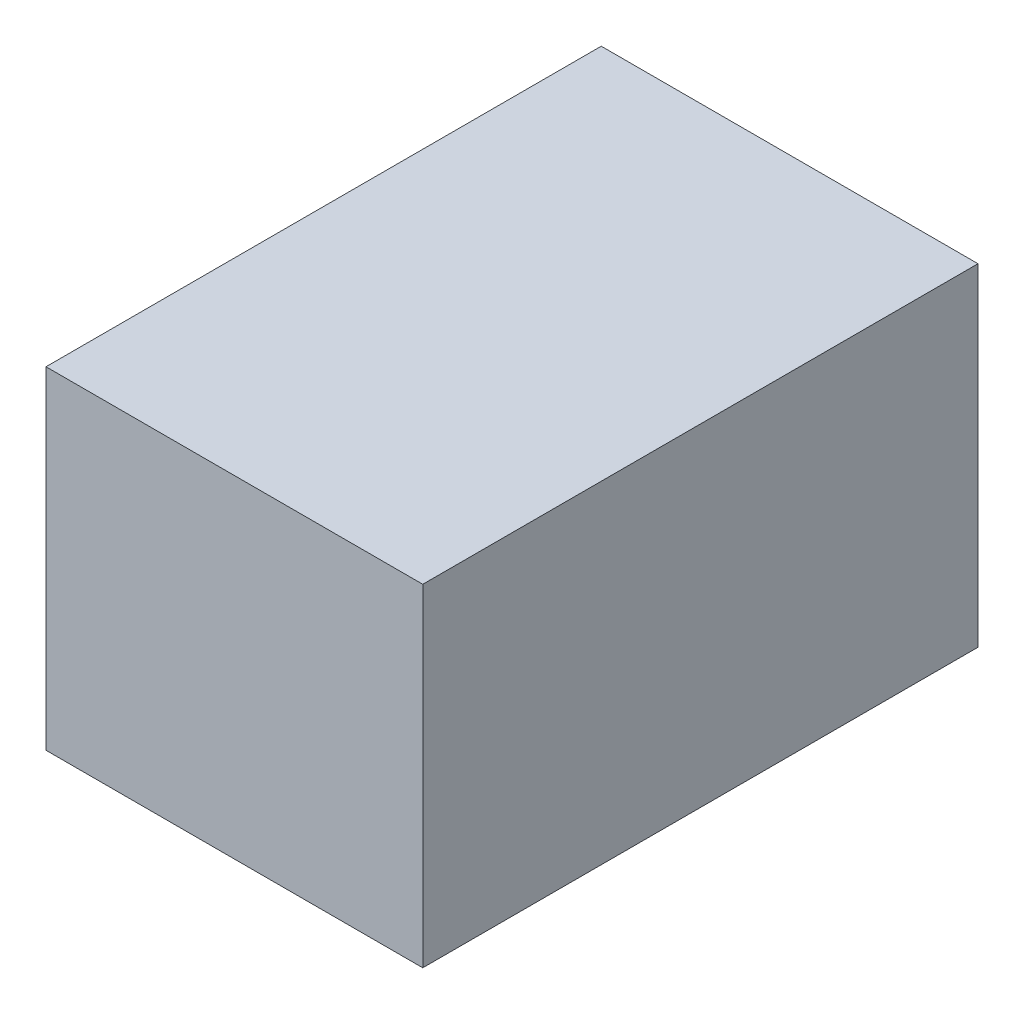
ISO-10303-21;
HEADER;
FILE_DESCRIPTION(('STEP AP214'),'2;1');
FILE_NAME('part.step','',(''),(''),'','','');
FILE_SCHEMA(('AUTOMOTIVE_DESIGN { 1 0 10303 214 1 1 1 1 }'));
ENDSEC;
DATA;
#1=APPLICATION_CONTEXT('core data for automotive mechanical design processes');
#2=APPLICATION_PROTOCOL_DEFINITION('international standard','automotive_design',2000,#1);
#3=PRODUCT_CONTEXT('',#1,'mechanical');
#4=PRODUCT('Part','Part','',(#3));
#5=PRODUCT_RELATED_PRODUCT_CATEGORY('part','',(#4));
#6=PRODUCT_DEFINITION_FORMATION('','',#4);
#7=PRODUCT_DEFINITION_CONTEXT('part definition',#1,'design');
#8=PRODUCT_DEFINITION('design','',#6,#7);
#9=PRODUCT_DEFINITION_SHAPE('','',#8);
#10=(LENGTH_UNIT() NAMED_UNIT(*) SI_UNIT(.MILLI.,.METRE.));
#11=(NAMED_UNIT(*) PLANE_ANGLE_UNIT() SI_UNIT($,.RADIAN.));
#12=(NAMED_UNIT(*) SI_UNIT($,.STERADIAN.) SOLID_ANGLE_UNIT());
#13=UNCERTAINTY_MEASURE_WITH_UNIT(LENGTH_MEASURE(1.E-05),#10,'distance_accuracy_value','');
#14=(GEOMETRIC_REPRESENTATION_CONTEXT(3) GLOBAL_UNCERTAINTY_ASSIGNED_CONTEXT((#13)) GLOBAL_UNIT_ASSIGNED_CONTEXT((#10,
#11,#12)) REPRESENTATION_CONTEXT('',''));
#15=CARTESIAN_POINT('',(0.,0.,0.));
#16=DIRECTION('',(0.,0.,1.));
#17=DIRECTION('',(1.,0.,0.));
#18=AXIS2_PLACEMENT_3D('',#15,#16,#17);
#19=CARTESIAN_POINT('',(19.,-16.75,56.));
#20=DIRECTION('',(-1.,0.,0.));
#21=DIRECTION('',(0.,0.,1.));
#22=AXIS2_PLACEMENT_3D('',#19,#20,#21);
#23=PLANE('',#22);
#24=DIRECTION('',(0.,1.,0.));
#25=VECTOR('',#24,1.);
#26=CARTESIAN_POINT('',(19.,-16.75,0.));
#27=LINE('',#26,#25);
#28=CARTESIAN_POINT('',(19.,-16.75,0.));
#29=VERTEX_POINT('',#28);
#30=CARTESIAN_POINT('',(19.,16.75,0.));
#31=VERTEX_POINT('',#30);
#32=EDGE_CURVE('E113',#29,#31,#27,.T.);
#33=ORIENTED_EDGE('',*,*,#32,.T.);
#34=DIRECTION('',(0.,0.,-1.));
#35=VECTOR('',#34,1.);
#36=CARTESIAN_POINT('',(19.,16.75,56.));
#37=LINE('',#36,#35);
#38=CARTESIAN_POINT('',(19.,16.75,56.));
#39=VERTEX_POINT('',#38);
#40=EDGE_CURVE('E11',#39,#31,#37,.T.);
#41=ORIENTED_EDGE('',*,*,#40,.F.);
#42=DIRECTION('',(0.,1.,0.));
#43=VECTOR('',#42,1.);
#44=CARTESIAN_POINT('',(19.,-16.75,56.));
#45=LINE('',#44,#43);
#46=CARTESIAN_POINT('',(19.,-16.75,56.));
#47=VERTEX_POINT('',#46);
#48=EDGE_CURVE('E97',#47,#39,#45,.T.);
#49=ORIENTED_EDGE('',*,*,#48,.F.);
#50=DIRECTION('',(0.,0.,-1.));
#51=VECTOR('',#50,1.);
#52=CARTESIAN_POINT('',(19.,-16.75,56.));
#53=LINE('',#52,#51);
#54=EDGE_CURVE('E109',#47,#29,#53,.T.);
#55=ORIENTED_EDGE('',*,*,#54,.T.);
#56=EDGE_LOOP('',(#33,#41,#49,#55));
#57=FACE_BOUND('',#56,.T.);
#58=ADVANCED_FACE('F45',(#57),#23,.F.);
#59=CARTESIAN_POINT('',(-19.,16.75,56.));
#60=DIRECTION('',(0.,-1.,0.));
#61=DIRECTION('',(0.,0.,-1.));
#62=AXIS2_PLACEMENT_3D('',#59,#60,#61);
#63=PLANE('',#62);
#64=DIRECTION('',(-1.,0.,0.));
#65=VECTOR('',#64,1.);
#66=CARTESIAN_POINT('',(-19.,16.75,0.));
#67=LINE('',#66,#65);
#68=CARTESIAN_POINT('',(-19.,16.75,0.));
#69=VERTEX_POINT('',#68);
#70=EDGE_CURVE('E102',#31,#69,#67,.T.);
#71=ORIENTED_EDGE('',*,*,#70,.T.);
#72=DIRECTION('',(0.,0.,-1.));
#73=VECTOR('',#72,1.);
#74=CARTESIAN_POINT('',(-19.,16.75,56.));
#75=LINE('',#74,#73);
#76=CARTESIAN_POINT('',(-19.,16.75,56.));
#77=VERTEX_POINT('',#76);
#78=EDGE_CURVE('E54',#77,#69,#75,.T.);
#79=ORIENTED_EDGE('',*,*,#78,.F.);
#80=DIRECTION('',(-1.,0.,0.));
#81=VECTOR('',#80,1.);
#82=CARTESIAN_POINT('',(-19.,16.75,56.));
#83=LINE('',#82,#81);
#84=EDGE_CURVE('E92',#39,#77,#83,.T.);
#85=ORIENTED_EDGE('',*,*,#84,.F.);
#86=ORIENTED_EDGE('',*,*,#40,.T.);
#87=EDGE_LOOP('',(#71,#79,#85,#86));
#88=FACE_BOUND('',#87,.T.);
#89=ADVANCED_FACE('F101',(#88),#63,.F.);
#90=CARTESIAN_POINT('',(-19.,-16.75,56.));
#91=DIRECTION('',(1.,0.,0.));
#92=DIRECTION('',(0.,0.,-1.));
#93=AXIS2_PLACEMENT_3D('',#90,#91,#92);
#94=PLANE('',#93);
#95=DIRECTION('',(0.,-1.,0.));
#96=VECTOR('',#95,1.);
#97=CARTESIAN_POINT('',(-19.,-16.75,0.));
#98=LINE('',#97,#96);
#99=CARTESIAN_POINT('',(-19.,-16.75,0.));
#100=VERTEX_POINT('',#99);
#101=EDGE_CURVE('E79',#69,#100,#98,.T.);
#102=ORIENTED_EDGE('',*,*,#101,.T.);
#103=DIRECTION('',(0.,0.,-1.));
#104=VECTOR('',#103,1.);
#105=CARTESIAN_POINT('',(-19.,-16.75,56.));
#106=LINE('',#105,#104);
#107=CARTESIAN_POINT('',(-19.,-16.75,56.));
#108=VERTEX_POINT('',#107);
#109=EDGE_CURVE('E104',#108,#100,#106,.T.);
#110=ORIENTED_EDGE('',*,*,#109,.F.);
#111=DIRECTION('',(0.,-1.,0.));
#112=VECTOR('',#111,1.);
#113=CARTESIAN_POINT('',(-19.,-16.75,56.));
#114=LINE('',#113,#112);
#115=EDGE_CURVE('E95',#77,#108,#114,.T.);
#116=ORIENTED_EDGE('',*,*,#115,.F.);
#117=ORIENTED_EDGE('',*,*,#78,.T.);
#118=EDGE_LOOP('',(#102,#110,#116,#117));
#119=FACE_BOUND('',#118,.T.);
#120=ADVANCED_FACE('F105',(#119),#94,.F.);
#121=CARTESIAN_POINT('',(-19.,-16.75,56.));
#122=DIRECTION('',(0.,1.,0.));
#123=DIRECTION('',(0.,0.,1.));
#124=AXIS2_PLACEMENT_3D('',#121,#122,#123);
#125=PLANE('',#124);
#126=DIRECTION('',(1.,0.,0.));
#127=VECTOR('',#126,1.);
#128=CARTESIAN_POINT('',(-19.,-16.75,0.));
#129=LINE('',#128,#127);
#130=EDGE_CURVE('E85',#100,#29,#129,.T.);
#131=ORIENTED_EDGE('',*,*,#130,.T.);
#132=ORIENTED_EDGE('',*,*,#54,.F.);
#133=DIRECTION('',(1.,0.,0.));
#134=VECTOR('',#133,1.);
#135=CARTESIAN_POINT('',(-19.,-16.75,56.));
#136=LINE('',#135,#134);
#137=EDGE_CURVE('E62',#108,#47,#136,.T.);
#138=ORIENTED_EDGE('',*,*,#137,.F.);
#139=ORIENTED_EDGE('',*,*,#109,.T.);
#140=EDGE_LOOP('',(#131,#132,#138,#139));
#141=FACE_BOUND('',#140,.T.);
#142=ADVANCED_FACE('F126',(#141),#125,.F.);
#143=CARTESIAN_POINT('',(0.,0.,56.));
#144=DIRECTION('',(0.,0.,-1.));
#145=DIRECTION('',(-1.,0.,0.));
#146=AXIS2_PLACEMENT_3D('',#143,#144,#145);
#147=PLANE('',#146);
#148=ORIENTED_EDGE('',*,*,#48,.T.);
#149=ORIENTED_EDGE('',*,*,#84,.T.);
#150=ORIENTED_EDGE('',*,*,#115,.T.);
#151=ORIENTED_EDGE('',*,*,#137,.T.);
#152=EDGE_LOOP('',(#148,#149,#150,#151));
#153=FACE_BOUND('',#152,.T.);
#154=ADVANCED_FACE('F93',(#153),#147,.F.);
#155=CARTESIAN_POINT('',(0.,0.,0.));
#156=DIRECTION('',(0.,0.,-1.));
#157=DIRECTION('',(-1.,0.,0.));
#158=AXIS2_PLACEMENT_3D('',#155,#156,#157);
#159=PLANE('',#158);
#160=ORIENTED_EDGE('',*,*,#32,.F.);
#161=ORIENTED_EDGE('',*,*,#130,.F.);
#162=ORIENTED_EDGE('',*,*,#101,.F.);
#163=ORIENTED_EDGE('',*,*,#70,.F.);
#164=EDGE_LOOP('',(#160,#161,#162,#163));
#165=FACE_BOUND('',#164,.T.);
#166=ADVANCED_FACE('F129',(#165),#159,.T.);
#167=CLOSED_SHELL('',(#58,#89,#120,#142,#154,#166));
#168=MANIFOLD_SOLID_BREP('B2',#167);
#169=ADVANCED_BREP_SHAPE_REPRESENTATION('',(#18,#168),#14);
#170=SHAPE_DEFINITION_REPRESENTATION(#9,#169);
ENDSEC;
END-ISO-10303-21;
